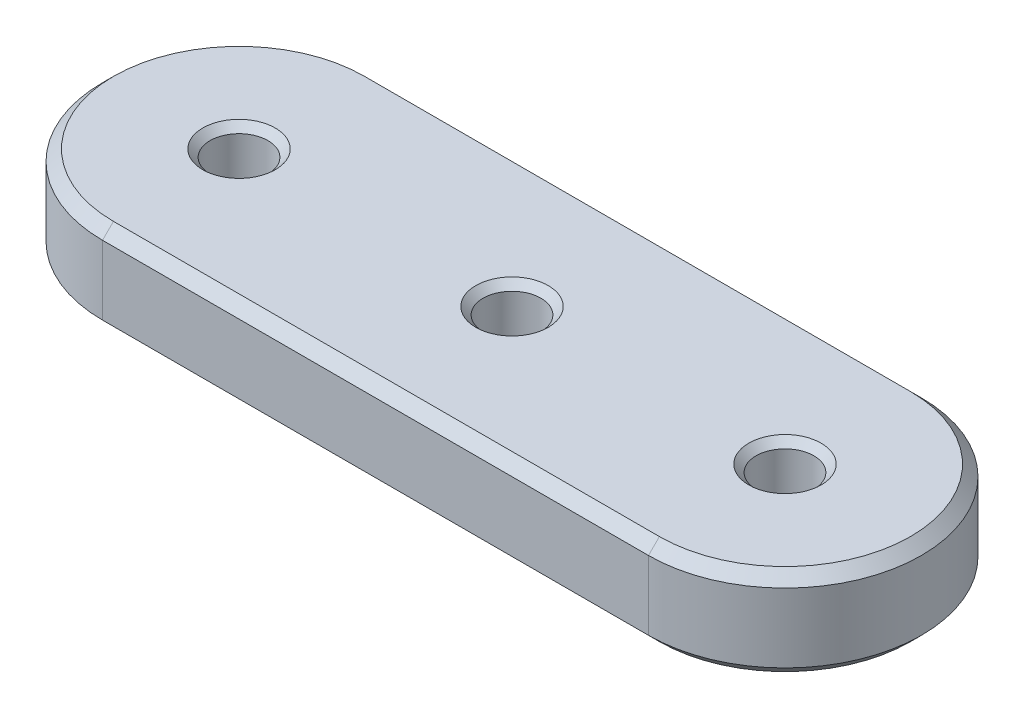
ISO-10303-21;
HEADER;
FILE_DESCRIPTION(('STEP AP214'),'2;1');
FILE_NAME('part.step','',(''),(''),'','','');
FILE_SCHEMA(('AUTOMOTIVE_DESIGN { 1 0 10303 214 1 1 1 1 }'));
ENDSEC;
DATA;
#1=APPLICATION_CONTEXT('core data for automotive mechanical design processes');
#2=APPLICATION_PROTOCOL_DEFINITION('international standard','automotive_design',2000,#1);
#3=PRODUCT_CONTEXT('',#1,'mechanical');
#4=PRODUCT('Part','Part','',(#3));
#5=PRODUCT_RELATED_PRODUCT_CATEGORY('part','',(#4));
#6=PRODUCT_DEFINITION_FORMATION('','',#4);
#7=PRODUCT_DEFINITION_CONTEXT('part definition',#1,'design');
#8=PRODUCT_DEFINITION('design','',#6,#7);
#9=PRODUCT_DEFINITION_SHAPE('','',#8);
#10=(LENGTH_UNIT() NAMED_UNIT(*) SI_UNIT(.MILLI.,.METRE.));
#11=(NAMED_UNIT(*) PLANE_ANGLE_UNIT() SI_UNIT($,.RADIAN.));
#12=(NAMED_UNIT(*) SI_UNIT($,.STERADIAN.) SOLID_ANGLE_UNIT());
#13=UNCERTAINTY_MEASURE_WITH_UNIT(LENGTH_MEASURE(1.E-05),#10,'distance_accuracy_value','');
#14=(GEOMETRIC_REPRESENTATION_CONTEXT(3) GLOBAL_UNCERTAINTY_ASSIGNED_CONTEXT((#13)) GLOBAL_UNIT_ASSIGNED_CONTEXT((#10,
#11,#12)) REPRESENTATION_CONTEXT('',''));
#15=CARTESIAN_POINT('',(0.,0.,0.));
#16=DIRECTION('',(0.,0.,1.));
#17=DIRECTION('',(1.,0.,0.));
#18=AXIS2_PLACEMENT_3D('',#15,#16,#17);
#19=CARTESIAN_POINT('',(-19.05,3.175,0.));
#20=DIRECTION('',(0.,-1.,0.));
#21=DIRECTION('',(0.,0.,-1.));
#22=AXIS2_PLACEMENT_3D('',#19,#20,#21);
#23=CYLINDRICAL_SURFACE('',#22,9.525);
#24=DIRECTION('',(0.,-1.,0.));
#25=VECTOR('',#24,1.);
#26=CARTESIAN_POINT('',(-19.05,3.175,9.525));
#27=LINE('',#26,#25);
#28=CARTESIAN_POINT('',(-19.05,2.413,9.525));
#29=VERTEX_POINT('',#28);
#30=CARTESIAN_POINT('',(-19.05,-2.41300000000001,9.525));
#31=VERTEX_POINT('',#30);
#32=EDGE_CURVE('E108',#29,#31,#27,.T.);
#33=ORIENTED_EDGE('',*,*,#32,.F.);
#34=CARTESIAN_POINT('',(-19.05,2.413,0.));
#35=DIRECTION('',(0.,1.,0.));
#36=DIRECTION('',(0.,0.,1.));
#37=AXIS2_PLACEMENT_3D('',#34,#35,#36);
#38=CIRCLE('',#37,9.525);
#39=CARTESIAN_POINT('',(-19.05,2.413,-9.525));
#40=VERTEX_POINT('',#39);
#41=EDGE_CURVE('E104',#29,#40,#38,.F.);
#42=ORIENTED_EDGE('',*,*,#41,.T.);
#43=DIRECTION('',(0.,-1.,0.));
#44=VECTOR('',#43,1.);
#45=CARTESIAN_POINT('',(-19.05,3.175,-9.525));
#46=LINE('',#45,#44);
#47=CARTESIAN_POINT('',(-19.05,-2.41300000000001,-9.525));
#48=VERTEX_POINT('',#47);
#49=EDGE_CURVE('E106',#40,#48,#46,.T.);
#50=ORIENTED_EDGE('',*,*,#49,.T.);
#51=CARTESIAN_POINT('',(-19.05,-2.41300000000001,0.));
#52=DIRECTION('',(0.,1.,0.));
#53=DIRECTION('',(0.,0.,1.));
#54=AXIS2_PLACEMENT_3D('',#51,#52,#53);
#55=CIRCLE('',#54,9.525);
#56=EDGE_CURVE('E114',#48,#31,#55,.T.);
#57=ORIENTED_EDGE('',*,*,#56,.T.);
#58=EDGE_LOOP('',(#33,#42,#50,#57));
#59=FACE_BOUND('',#58,.T.);
#60=ADVANCED_FACE('F35',(#59),#23,.T.);
#61=CARTESIAN_POINT('',(-19.05,3.175,9.525));
#62=DIRECTION('',(0.,0.,-1.));
#63=DIRECTION('',(-1.,0.,0.));
#64=AXIS2_PLACEMENT_3D('',#61,#62,#63);
#65=PLANE('',#64);
#66=DIRECTION('',(0.,-1.,0.));
#67=VECTOR('',#66,1.);
#68=CARTESIAN_POINT('',(19.05,3.175,9.52499999999999));
#69=LINE('',#68,#67);
#70=CARTESIAN_POINT('',(19.05,2.413,9.52499999999999));
#71=VERTEX_POINT('',#70);
#72=CARTESIAN_POINT('',(19.05,-2.41300000000001,9.52499999999999));
#73=VERTEX_POINT('',#72);
#74=EDGE_CURVE('E449',#71,#73,#69,.T.);
#75=ORIENTED_EDGE('',*,*,#74,.F.);
#76=DIRECTION('',(-1.,0.,0.));
#77=VECTOR('',#76,1.);
#78=CARTESIAN_POINT('',(-19.05,2.413,9.525));
#79=LINE('',#78,#77);
#80=EDGE_CURVE('E158',#71,#29,#79,.T.);
#81=ORIENTED_EDGE('',*,*,#80,.T.);
#82=ORIENTED_EDGE('',*,*,#32,.T.);
#83=DIRECTION('',(1.,0.,0.));
#84=VECTOR('',#83,1.);
#85=CARTESIAN_POINT('',(-19.05,-2.41300000000001,9.525));
#86=LINE('',#85,#84);
#87=EDGE_CURVE('E156',#31,#73,#86,.T.);
#88=ORIENTED_EDGE('',*,*,#87,.T.);
#89=EDGE_LOOP('',(#75,#81,#82,#88));
#90=FACE_BOUND('',#89,.T.);
#91=ADVANCED_FACE('F236',(#90),#65,.F.);
#92=CARTESIAN_POINT('',(19.05,3.175,0.));
#93=DIRECTION('',(0.,-1.,0.));
#94=DIRECTION('',(0.,0.,-1.));
#95=AXIS2_PLACEMENT_3D('',#92,#93,#94);
#96=CYLINDRICAL_SURFACE('',#95,9.525);
#97=DIRECTION('',(0.,-1.,0.));
#98=VECTOR('',#97,1.);
#99=CARTESIAN_POINT('',(19.05,3.175,-9.52500000000001));
#100=LINE('',#99,#98);
#101=CARTESIAN_POINT('',(19.05,2.413,-9.52500000000001));
#102=VERTEX_POINT('',#101);
#103=CARTESIAN_POINT('',(19.05,-2.41300000000001,-9.52500000000001));
#104=VERTEX_POINT('',#103);
#105=EDGE_CURVE('E125',#102,#104,#100,.T.);
#106=ORIENTED_EDGE('',*,*,#105,.F.);
#107=CARTESIAN_POINT('',(19.05,2.413,0.));
#108=DIRECTION('',(0.,1.,0.));
#109=DIRECTION('',(0.,0.,1.));
#110=AXIS2_PLACEMENT_3D('',#107,#108,#109);
#111=CIRCLE('',#110,9.525);
#112=EDGE_CURVE('E154',#102,#71,#111,.F.);
#113=ORIENTED_EDGE('',*,*,#112,.T.);
#114=ORIENTED_EDGE('',*,*,#74,.T.);
#115=CARTESIAN_POINT('',(19.05,-2.41300000000001,0.));
#116=DIRECTION('',(0.,1.,0.));
#117=DIRECTION('',(0.,0.,1.));
#118=AXIS2_PLACEMENT_3D('',#115,#116,#117);
#119=CIRCLE('',#118,9.525);
#120=EDGE_CURVE('E113',#73,#104,#119,.T.);
#121=ORIENTED_EDGE('',*,*,#120,.T.);
#122=EDGE_LOOP('',(#106,#113,#114,#121));
#123=FACE_BOUND('',#122,.T.);
#124=ADVANCED_FACE('F241',(#123),#96,.T.);
#125=CARTESIAN_POINT('',(-19.05,3.175,-9.525));
#126=DIRECTION('',(0.,0.,-1.));
#127=DIRECTION('',(-1.,0.,0.));
#128=AXIS2_PLACEMENT_3D('',#125,#126,#127);
#129=PLANE('',#128);
#130=ORIENTED_EDGE('',*,*,#49,.F.);
#131=DIRECTION('',(1.,0.,0.));
#132=VECTOR('',#131,1.);
#133=CARTESIAN_POINT('',(-19.05,2.413,-9.525));
#134=LINE('',#133,#132);
#135=EDGE_CURVE('E122',#40,#102,#134,.T.);
#136=ORIENTED_EDGE('',*,*,#135,.T.);
#137=ORIENTED_EDGE('',*,*,#105,.T.);
#138=DIRECTION('',(-1.,0.,0.));
#139=VECTOR('',#138,1.);
#140=CARTESIAN_POINT('',(-19.05,-2.41300000000001,-9.525));
#141=LINE('',#140,#139);
#142=EDGE_CURVE('E124',#104,#48,#141,.T.);
#143=ORIENTED_EDGE('',*,*,#142,.T.);
#144=EDGE_LOOP('',(#130,#136,#137,#143));
#145=FACE_BOUND('',#144,.T.);
#146=ADVANCED_FACE('F119',(#145),#129,.T.);
#147=CARTESIAN_POINT('',(-19.05,3.175,0.));
#148=DIRECTION('',(0.,1.,0.));
#149=DIRECTION('',(0.,0.,1.));
#150=AXIS2_PLACEMENT_3D('',#147,#148,#149);
#151=PLANE('',#150);
#152=CARTESIAN_POINT('',(19.05,3.175,0.));
#153=DIRECTION('',(0.,1.,0.));
#154=DIRECTION('',(0.,0.,1.));
#155=AXIS2_PLACEMENT_3D('',#152,#153,#154);
#156=CIRCLE('',#155,2.5273);
#157=CARTESIAN_POINT('',(19.05,3.175,2.5273));
#158=VERTEX_POINT('',#157);
#159=EDGE_CURVE('E192',#158,#158,#156,.F.);
#160=ORIENTED_EDGE('',*,*,#159,.T.);
#161=EDGE_LOOP('',(#160));
#162=FACE_BOUND('',#161,.T.);
#163=CARTESIAN_POINT('',(0.,3.175,0.));
#164=DIRECTION('',(0.,1.,0.));
#165=DIRECTION('',(0.,0.,1.));
#166=AXIS2_PLACEMENT_3D('',#163,#164,#165);
#167=CIRCLE('',#166,2.52730000000002);
#168=CARTESIAN_POINT('',(0.,3.175,2.52730000000002));
#169=VERTEX_POINT('',#168);
#170=EDGE_CURVE('E189',#169,#169,#167,.F.);
#171=ORIENTED_EDGE('',*,*,#170,.T.);
#172=EDGE_LOOP('',(#171));
#173=FACE_BOUND('',#172,.T.);
#174=CARTESIAN_POINT('',(-19.05,3.175,0.));
#175=DIRECTION('',(0.,1.,0.));
#176=DIRECTION('',(0.,0.,1.));
#177=AXIS2_PLACEMENT_3D('',#174,#175,#176);
#178=CIRCLE('',#177,2.5273);
#179=CARTESIAN_POINT('',(-19.05,3.175,2.5273));
#180=VERTEX_POINT('',#179);
#181=EDGE_CURVE('E186',#180,#180,#178,.F.);
#182=ORIENTED_EDGE('',*,*,#181,.T.);
#183=EDGE_LOOP('',(#182));
#184=FACE_BOUND('',#183,.T.);
#185=CARTESIAN_POINT('',(19.05,3.175,0.));
#186=DIRECTION('',(0.,1.,0.));
#187=DIRECTION('',(0.,0.,1.));
#188=AXIS2_PLACEMENT_3D('',#185,#186,#187);
#189=CIRCLE('',#188,8.76300000000001);
#190=CARTESIAN_POINT('',(19.05,3.175,8.763));
#191=VERTEX_POINT('',#190);
#192=CARTESIAN_POINT('',(19.05,3.175,-8.76300000000002));
#193=VERTEX_POINT('',#192);
#194=EDGE_CURVE('E143',#191,#193,#189,.T.);
#195=ORIENTED_EDGE('',*,*,#194,.T.);
#196=DIRECTION('',(-1.,0.,0.));
#197=VECTOR('',#196,1.);
#198=CARTESIAN_POINT('',(-19.05,3.175,-8.76300000000001));
#199=LINE('',#198,#197);
#200=CARTESIAN_POINT('',(-19.05,3.175,-8.76300000000001));
#201=VERTEX_POINT('',#200);
#202=EDGE_CURVE('E150',#193,#201,#199,.T.);
#203=ORIENTED_EDGE('',*,*,#202,.T.);
#204=CARTESIAN_POINT('',(-19.05,3.175,0.));
#205=DIRECTION('',(0.,1.,0.));
#206=DIRECTION('',(0.,0.,1.));
#207=AXIS2_PLACEMENT_3D('',#204,#205,#206);
#208=CIRCLE('',#207,8.76300000000001);
#209=CARTESIAN_POINT('',(-19.05,3.175,8.76300000000001));
#210=VERTEX_POINT('',#209);
#211=EDGE_CURVE('E131',#201,#210,#208,.T.);
#212=ORIENTED_EDGE('',*,*,#211,.T.);
#213=DIRECTION('',(1.,0.,0.));
#214=VECTOR('',#213,1.);
#215=CARTESIAN_POINT('',(19.05,3.175,8.763));
#216=LINE('',#215,#214);
#217=EDGE_CURVE('E141',#210,#191,#216,.T.);
#218=ORIENTED_EDGE('',*,*,#217,.T.);
#219=EDGE_LOOP('',(#195,#203,#212,#218));
#220=FACE_BOUND('',#219,.T.);
#221=ADVANCED_FACE('F222',(#162,#173,#184,#220),#151,.T.);
#222=CARTESIAN_POINT('',(-19.05,-3.175,0.));
#223=DIRECTION('',(0.,1.,0.));
#224=DIRECTION('',(0.,0.,1.));
#225=AXIS2_PLACEMENT_3D('',#222,#223,#224);
#226=PLANE('',#225);
#227=CARTESIAN_POINT('',(19.05,-3.175,0.));
#228=DIRECTION('',(0.,1.,0.));
#229=DIRECTION('',(0.,0.,1.));
#230=AXIS2_PLACEMENT_3D('',#227,#228,#229);
#231=CIRCLE('',#230,2.52729999999999);
#232=CARTESIAN_POINT('',(19.05,-3.175,2.52729999999998));
#233=VERTEX_POINT('',#232);
#234=EDGE_CURVE('E201',#233,#233,#231,.T.);
#235=ORIENTED_EDGE('',*,*,#234,.T.);
#236=EDGE_LOOP('',(#235));
#237=FACE_BOUND('',#236,.T.);
#238=CARTESIAN_POINT('',(0.,-3.175,0.));
#239=DIRECTION('',(0.,1.,0.));
#240=DIRECTION('',(0.,0.,1.));
#241=AXIS2_PLACEMENT_3D('',#238,#239,#240);
#242=CIRCLE('',#241,2.52729999999999);
#243=CARTESIAN_POINT('',(0.,-3.175,2.52729999999999));
#244=VERTEX_POINT('',#243);
#245=EDGE_CURVE('E198',#244,#244,#242,.T.);
#246=ORIENTED_EDGE('',*,*,#245,.T.);
#247=EDGE_LOOP('',(#246));
#248=FACE_BOUND('',#247,.T.);
#249=CARTESIAN_POINT('',(-19.05,-3.175,0.));
#250=DIRECTION('',(0.,1.,0.));
#251=DIRECTION('',(0.,0.,1.));
#252=AXIS2_PLACEMENT_3D('',#249,#250,#251);
#253=CIRCLE('',#252,2.52729999999999);
#254=CARTESIAN_POINT('',(-19.05,-3.175,2.52729999999999));
#255=VERTEX_POINT('',#254);
#256=EDGE_CURVE('E195',#255,#255,#253,.T.);
#257=ORIENTED_EDGE('',*,*,#256,.T.);
#258=EDGE_LOOP('',(#257));
#259=FACE_BOUND('',#258,.T.);
#260=CARTESIAN_POINT('',(-19.05,-3.175,0.));
#261=DIRECTION('',(0.,1.,0.));
#262=DIRECTION('',(0.,0.,1.));
#263=AXIS2_PLACEMENT_3D('',#260,#261,#262);
#264=CIRCLE('',#263,8.763);
#265=CARTESIAN_POINT('',(-19.05,-3.175,8.763));
#266=VERTEX_POINT('',#265);
#267=CARTESIAN_POINT('',(-19.05,-3.175,-8.763));
#268=VERTEX_POINT('',#267);
#269=EDGE_CURVE('E50',#266,#268,#264,.F.);
#270=ORIENTED_EDGE('',*,*,#269,.T.);
#271=DIRECTION('',(1.,0.,0.));
#272=VECTOR('',#271,1.);
#273=CARTESIAN_POINT('',(19.05,-3.175,-8.76300000000001));
#274=LINE('',#273,#272);
#275=CARTESIAN_POINT('',(19.05,-3.175,-8.76300000000001));
#276=VERTEX_POINT('',#275);
#277=EDGE_CURVE('E165',#268,#276,#274,.T.);
#278=ORIENTED_EDGE('',*,*,#277,.T.);
#279=CARTESIAN_POINT('',(19.05,-3.175,0.));
#280=DIRECTION('',(0.,1.,0.));
#281=DIRECTION('',(0.,0.,1.));
#282=AXIS2_PLACEMENT_3D('',#279,#280,#281);
#283=CIRCLE('',#282,8.763);
#284=CARTESIAN_POINT('',(19.05,-3.175,8.76299999999999));
#285=VERTEX_POINT('',#284);
#286=EDGE_CURVE('E162',#276,#285,#283,.F.);
#287=ORIENTED_EDGE('',*,*,#286,.T.);
#288=DIRECTION('',(-1.,0.,0.));
#289=VECTOR('',#288,1.);
#290=CARTESIAN_POINT('',(-19.05,-3.175,8.763));
#291=LINE('',#290,#289);
#292=EDGE_CURVE('E160',#285,#266,#291,.T.);
#293=ORIENTED_EDGE('',*,*,#292,.T.);
#294=EDGE_LOOP('',(#270,#278,#287,#293));
#295=FACE_BOUND('',#294,.T.);
#296=ADVANCED_FACE('F219',(#237,#248,#259,#295),#226,.F.);
#297=CARTESIAN_POINT('',(0.,3.175,0.));
#298=DIRECTION('',(0.,1.,0.));
#299=DIRECTION('',(0.,0.,1.));
#300=AXIS2_PLACEMENT_3D('',#297,#298,#299);
#301=CYLINDRICAL_SURFACE('',#300,2.0193);
#302=CARTESIAN_POINT('',(0.,2.66699999999999,0.));
#303=DIRECTION('',(0.,1.,0.));
#304=DIRECTION('',(0.,0.,1.));
#305=AXIS2_PLACEMENT_3D('',#302,#303,#304);
#306=CIRCLE('',#305,2.0193);
#307=CARTESIAN_POINT('',(0.,2.66699999999999,2.0193));
#308=VERTEX_POINT('',#307);
#309=EDGE_CURVE('E207',#308,#308,#306,.T.);
#310=ORIENTED_EDGE('',*,*,#309,.T.);
#311=EDGE_LOOP('',(#310));
#312=FACE_BOUND('',#311,.T.);
#313=CARTESIAN_POINT('',(0.,-2.667,0.));
#314=DIRECTION('',(0.,1.,0.));
#315=DIRECTION('',(0.,0.,1.));
#316=AXIS2_PLACEMENT_3D('',#313,#314,#315);
#317=CIRCLE('',#316,2.0193);
#318=CARTESIAN_POINT('',(0.,-2.667,2.0193));
#319=VERTEX_POINT('',#318);
#320=EDGE_CURVE('E204',#319,#319,#317,.F.);
#321=ORIENTED_EDGE('',*,*,#320,.T.);
#322=EDGE_LOOP('',(#321));
#323=FACE_BOUND('',#322,.T.);
#324=ADVANCED_FACE('F221',(#312,#323),#301,.F.);
#325=CARTESIAN_POINT('',(-19.05,3.175,0.));
#326=DIRECTION('',(0.,1.,0.));
#327=DIRECTION('',(0.,0.,1.));
#328=AXIS2_PLACEMENT_3D('',#325,#326,#327);
#329=CYLINDRICAL_SURFACE('',#328,2.0193);
#330=CARTESIAN_POINT('',(-19.05,2.66699999999999,0.));
#331=DIRECTION('',(0.,1.,0.));
#332=DIRECTION('',(0.,0.,1.));
#333=AXIS2_PLACEMENT_3D('',#330,#331,#332);
#334=CIRCLE('',#333,2.0193);
#335=CARTESIAN_POINT('',(-19.05,2.66699999999999,2.0193));
#336=VERTEX_POINT('',#335);
#337=EDGE_CURVE('E11',#336,#336,#334,.T.);
#338=ORIENTED_EDGE('',*,*,#337,.T.);
#339=EDGE_LOOP('',(#338));
#340=FACE_BOUND('',#339,.T.);
#341=CARTESIAN_POINT('',(-19.05,-2.667,0.));
#342=DIRECTION('',(0.,1.,0.));
#343=DIRECTION('',(0.,0.,1.));
#344=AXIS2_PLACEMENT_3D('',#341,#342,#343);
#345=CIRCLE('',#344,2.0193);
#346=CARTESIAN_POINT('',(-19.05,-2.667,2.0193));
#347=VERTEX_POINT('',#346);
#348=EDGE_CURVE('E43',#347,#347,#345,.F.);
#349=ORIENTED_EDGE('',*,*,#348,.T.);
#350=EDGE_LOOP('',(#349));
#351=FACE_BOUND('',#350,.T.);
#352=ADVANCED_FACE('F212',(#340,#351),#329,.F.);
#353=CARTESIAN_POINT('',(19.05,3.175,0.));
#354=DIRECTION('',(0.,1.,0.));
#355=DIRECTION('',(0.,0.,1.));
#356=AXIS2_PLACEMENT_3D('',#353,#354,#355);
#357=CYLINDRICAL_SURFACE('',#356,2.0193);
#358=CARTESIAN_POINT('',(19.05,2.66699999999999,0.));
#359=DIRECTION('',(0.,1.,0.));
#360=DIRECTION('',(0.,0.,1.));
#361=AXIS2_PLACEMENT_3D('',#358,#359,#360);
#362=CIRCLE('',#361,2.0193);
#363=CARTESIAN_POINT('',(19.05,2.66699999999999,2.01929999999999));
#364=VERTEX_POINT('',#363);
#365=EDGE_CURVE('E183',#364,#364,#362,.T.);
#366=ORIENTED_EDGE('',*,*,#365,.T.);
#367=EDGE_LOOP('',(#366));
#368=FACE_BOUND('',#367,.T.);
#369=CARTESIAN_POINT('',(19.05,-2.667,0.));
#370=DIRECTION('',(0.,1.,0.));
#371=DIRECTION('',(0.,0.,1.));
#372=AXIS2_PLACEMENT_3D('',#369,#370,#371);
#373=CIRCLE('',#372,2.0193);
#374=CARTESIAN_POINT('',(19.05,-2.667,2.01929999999999));
#375=VERTEX_POINT('',#374);
#376=EDGE_CURVE('E167',#375,#375,#373,.F.);
#377=ORIENTED_EDGE('',*,*,#376,.T.);
#378=EDGE_LOOP('',(#377));
#379=FACE_BOUND('',#378,.T.);
#380=ADVANCED_FACE('F258',(#368,#379),#357,.F.);
#381=CARTESIAN_POINT('',(-19.05,3.175,8.76300000000001));
#382=DIRECTION('',(0.,0.707106781186544,0.707106781186551));
#383=DIRECTION('',(-1.,0.,0.));
#384=AXIS2_PLACEMENT_3D('',#381,#382,#383);
#385=PLANE('',#384);
#386=DIRECTION('',(0.,-0.707106781186551,0.707106781186544));
#387=VECTOR('',#386,1.);
#388=CARTESIAN_POINT('',(19.05,3.175,8.763));
#389=LINE('',#388,#387);
#390=EDGE_CURVE('E135',#191,#71,#389,.T.);
#391=ORIENTED_EDGE('',*,*,#390,.F.);
#392=ORIENTED_EDGE('',*,*,#217,.F.);
#393=DIRECTION('',(0.,0.707106781186551,-0.707106781186544));
#394=VECTOR('',#393,1.);
#395=CARTESIAN_POINT('',(-19.05,2.413,9.525));
#396=LINE('',#395,#394);
#397=EDGE_CURVE('E126',#29,#210,#396,.T.);
#398=ORIENTED_EDGE('',*,*,#397,.F.);
#399=ORIENTED_EDGE('',*,*,#80,.F.);
#400=EDGE_LOOP('',(#391,#392,#398,#399));
#401=FACE_BOUND('',#400,.T.);
#402=ADVANCED_FACE('F255',(#401),#385,.T.);
#403=CARTESIAN_POINT('',(-19.05,3.175,0.));
#404=DIRECTION('',(0.,-1.,0.));
#405=DIRECTION('',(0.,0.,-1.));
#406=AXIS2_PLACEMENT_3D('',#403,#404,#405);
#407=CONICAL_SURFACE('',#406,8.76300000000001,0.785398163397444);
#408=ORIENTED_EDGE('',*,*,#397,.T.);
#409=ORIENTED_EDGE('',*,*,#211,.F.);
#410=DIRECTION('',(0.,0.707106781186551,0.707106781186544));
#411=VECTOR('',#410,1.);
#412=CARTESIAN_POINT('',(-19.05,2.413,-9.525));
#413=LINE('',#412,#411);
#414=EDGE_CURVE('E129',#40,#201,#413,.T.);
#415=ORIENTED_EDGE('',*,*,#414,.F.);
#416=ORIENTED_EDGE('',*,*,#41,.F.);
#417=EDGE_LOOP('',(#408,#409,#415,#416));
#418=FACE_BOUND('',#417,.T.);
#419=ADVANCED_FACE('F130',(#418),#407,.T.);
#420=CARTESIAN_POINT('',(19.05,3.175,0.));
#421=DIRECTION('',(0.,-1.,0.));
#422=DIRECTION('',(0.,0.,-1.));
#423=AXIS2_PLACEMENT_3D('',#420,#421,#422);
#424=CONICAL_SURFACE('',#423,8.76300000000001,0.785398163397444);
#425=ORIENTED_EDGE('',*,*,#390,.T.);
#426=ORIENTED_EDGE('',*,*,#112,.F.);
#427=DIRECTION('',(0.,-0.707106781186551,-0.707106781186544));
#428=VECTOR('',#427,1.);
#429=CARTESIAN_POINT('',(19.05,3.175,-8.76300000000002));
#430=LINE('',#429,#428);
#431=EDGE_CURVE('E136',#193,#102,#430,.T.);
#432=ORIENTED_EDGE('',*,*,#431,.F.);
#433=ORIENTED_EDGE('',*,*,#194,.F.);
#434=EDGE_LOOP('',(#425,#426,#432,#433));
#435=FACE_BOUND('',#434,.T.);
#436=ADVANCED_FACE('F249',(#435),#424,.T.);
#437=CARTESIAN_POINT('',(-19.05,2.413,-9.525));
#438=DIRECTION('',(0.,-0.707106781186544,0.707106781186551));
#439=DIRECTION('',(1.,0.,0.));
#440=AXIS2_PLACEMENT_3D('',#437,#438,#439);
#441=PLANE('',#440);
#442=ORIENTED_EDGE('',*,*,#414,.T.);
#443=ORIENTED_EDGE('',*,*,#202,.F.);
#444=ORIENTED_EDGE('',*,*,#431,.T.);
#445=ORIENTED_EDGE('',*,*,#135,.F.);
#446=EDGE_LOOP('',(#442,#443,#444,#445));
#447=FACE_BOUND('',#446,.T.);
#448=ADVANCED_FACE('F138',(#447),#441,.F.);
#449=CARTESIAN_POINT('',(-19.05,-2.41300000000001,9.525));
#450=DIRECTION('',(0.,0.707106781186551,-0.707106781186544));
#451=DIRECTION('',(1.,0.,0.));
#452=AXIS2_PLACEMENT_3D('',#449,#450,#451);
#453=PLANE('',#452);
#454=DIRECTION('',(0.,-0.707106781186544,-0.707106781186551));
#455=VECTOR('',#454,1.);
#456=CARTESIAN_POINT('',(19.05,-2.41300000000001,9.52499999999999));
#457=LINE('',#456,#455);
#458=EDGE_CURVE('E176',#73,#285,#457,.T.);
#459=ORIENTED_EDGE('',*,*,#458,.F.);
#460=ORIENTED_EDGE('',*,*,#87,.F.);
#461=DIRECTION('',(0.,0.707106781186544,0.707106781186551));
#462=VECTOR('',#461,1.);
#463=CARTESIAN_POINT('',(-19.05,-3.175,8.763));
#464=LINE('',#463,#462);
#465=EDGE_CURVE('E168',#266,#31,#464,.T.);
#466=ORIENTED_EDGE('',*,*,#465,.F.);
#467=ORIENTED_EDGE('',*,*,#292,.F.);
#468=EDGE_LOOP('',(#459,#460,#466,#467));
#469=FACE_BOUND('',#468,.T.);
#470=ADVANCED_FACE('F248',(#469),#453,.F.);
#471=CARTESIAN_POINT('',(-19.05,-2.41300000000001,0.));
#472=DIRECTION('',(0.,1.,0.));
#473=DIRECTION('',(0.,0.,1.));
#474=AXIS2_PLACEMENT_3D('',#471,#472,#473);
#475=CONICAL_SURFACE('',#474,9.525,0.785398163397453);
#476=ORIENTED_EDGE('',*,*,#465,.T.);
#477=ORIENTED_EDGE('',*,*,#56,.F.);
#478=DIRECTION('',(0.,0.707106781186544,-0.707106781186551));
#479=VECTOR('',#478,1.);
#480=CARTESIAN_POINT('',(-19.05,-3.175,-8.763));
#481=LINE('',#480,#479);
#482=EDGE_CURVE('E174',#268,#48,#481,.T.);
#483=ORIENTED_EDGE('',*,*,#482,.F.);
#484=ORIENTED_EDGE('',*,*,#269,.F.);
#485=EDGE_LOOP('',(#476,#477,#483,#484));
#486=FACE_BOUND('',#485,.T.);
#487=ADVANCED_FACE('F267',(#486),#475,.T.);
#488=CARTESIAN_POINT('',(19.05,-2.41300000000001,0.));
#489=DIRECTION('',(0.,1.,0.));
#490=DIRECTION('',(0.,0.,1.));
#491=AXIS2_PLACEMENT_3D('',#488,#489,#490);
#492=CONICAL_SURFACE('',#491,9.525,0.785398163397453);
#493=ORIENTED_EDGE('',*,*,#458,.T.);
#494=ORIENTED_EDGE('',*,*,#286,.F.);
#495=DIRECTION('',(0.,-0.707106781186544,0.707106781186551));
#496=VECTOR('',#495,1.);
#497=CARTESIAN_POINT('',(19.05,-2.41300000000001,-9.52500000000001));
#498=LINE('',#497,#496);
#499=EDGE_CURVE('E58',#104,#276,#498,.T.);
#500=ORIENTED_EDGE('',*,*,#499,.F.);
#501=ORIENTED_EDGE('',*,*,#120,.F.);
#502=EDGE_LOOP('',(#493,#494,#500,#501));
#503=FACE_BOUND('',#502,.T.);
#504=ADVANCED_FACE('F264',(#503),#492,.T.);
#505=CARTESIAN_POINT('',(-19.05,-3.175,-8.763));
#506=DIRECTION('',(0.,-0.707106781186551,-0.707106781186544));
#507=DIRECTION('',(-1.,0.,0.));
#508=AXIS2_PLACEMENT_3D('',#505,#506,#507);
#509=PLANE('',#508);
#510=ORIENTED_EDGE('',*,*,#482,.T.);
#511=ORIENTED_EDGE('',*,*,#142,.F.);
#512=ORIENTED_EDGE('',*,*,#499,.T.);
#513=ORIENTED_EDGE('',*,*,#277,.F.);
#514=EDGE_LOOP('',(#510,#511,#512,#513));
#515=FACE_BOUND('',#514,.T.);
#516=ADVANCED_FACE('F260',(#515),#509,.T.);
#517=CARTESIAN_POINT('',(19.05,2.66699999999999,0.));
#518=DIRECTION('',(0.,1.,0.));
#519=DIRECTION('',(0.,0.,1.));
#520=AXIS2_PLACEMENT_3D('',#517,#518,#519);
#521=CONICAL_SURFACE('',#520,2.0193,0.785398163397448);
#522=ORIENTED_EDGE('',*,*,#159,.F.);
#523=EDGE_LOOP('',(#522));
#524=FACE_BOUND('',#523,.T.);
#525=ORIENTED_EDGE('',*,*,#365,.F.);
#526=EDGE_LOOP('',(#525));
#527=FACE_BOUND('',#526,.T.);
#528=ADVANCED_FACE('F263',(#524,#527),#521,.F.);
#529=CARTESIAN_POINT('',(19.05,-3.175,0.));
#530=DIRECTION('',(0.,-1.,0.));
#531=DIRECTION('',(0.,0.,-1.));
#532=AXIS2_PLACEMENT_3D('',#529,#530,#531);
#533=CONICAL_SURFACE('',#532,2.52729999999999,0.785398163397442);
#534=ORIENTED_EDGE('',*,*,#376,.F.);
#535=EDGE_LOOP('',(#534));
#536=FACE_BOUND('',#535,.T.);
#537=ORIENTED_EDGE('',*,*,#234,.F.);
#538=EDGE_LOOP('',(#537));
#539=FACE_BOUND('',#538,.T.);
#540=ADVANCED_FACE('F277',(#536,#539),#533,.F.);
#541=CARTESIAN_POINT('',(0.,2.66699999999999,0.));
#542=DIRECTION('',(0.,1.,0.));
#543=DIRECTION('',(0.,0.,1.));
#544=AXIS2_PLACEMENT_3D('',#541,#542,#543);
#545=CONICAL_SURFACE('',#544,2.0193,0.785398163397455);
#546=ORIENTED_EDGE('',*,*,#170,.F.);
#547=EDGE_LOOP('',(#546));
#548=FACE_BOUND('',#547,.T.);
#549=ORIENTED_EDGE('',*,*,#309,.F.);
#550=EDGE_LOOP('',(#549));
#551=FACE_BOUND('',#550,.T.);
#552=ADVANCED_FACE('F281',(#548,#551),#545,.F.);
#553=CARTESIAN_POINT('',(0.,-3.175,0.));
#554=DIRECTION('',(0.,-1.,0.));
#555=DIRECTION('',(0.,0.,-1.));
#556=AXIS2_PLACEMENT_3D('',#553,#554,#555);
#557=CONICAL_SURFACE('',#556,2.52729999999999,0.785398163397442);
#558=ORIENTED_EDGE('',*,*,#320,.F.);
#559=EDGE_LOOP('',(#558));
#560=FACE_BOUND('',#559,.T.);
#561=ORIENTED_EDGE('',*,*,#245,.F.);
#562=EDGE_LOOP('',(#561));
#563=FACE_BOUND('',#562,.T.);
#564=ADVANCED_FACE('F285',(#560,#563),#557,.F.);
#565=CARTESIAN_POINT('',(-19.05,2.66699999999999,0.));
#566=DIRECTION('',(0.,1.,0.));
#567=DIRECTION('',(0.,0.,1.));
#568=AXIS2_PLACEMENT_3D('',#565,#566,#567);
#569=CONICAL_SURFACE('',#568,2.0193,0.785398163397448);
#570=ORIENTED_EDGE('',*,*,#181,.F.);
#571=EDGE_LOOP('',(#570));
#572=FACE_BOUND('',#571,.T.);
#573=ORIENTED_EDGE('',*,*,#337,.F.);
#574=EDGE_LOOP('',(#573));
#575=FACE_BOUND('',#574,.T.);
#576=ADVANCED_FACE('F216',(#572,#575),#569,.F.);
#577=CARTESIAN_POINT('',(-19.05,-3.175,0.));
#578=DIRECTION('',(0.,-1.,0.));
#579=DIRECTION('',(0.,0.,-1.));
#580=AXIS2_PLACEMENT_3D('',#577,#578,#579);
#581=CONICAL_SURFACE('',#580,2.52729999999999,0.785398163397442);
#582=ORIENTED_EDGE('',*,*,#348,.F.);
#583=EDGE_LOOP('',(#582));
#584=FACE_BOUND('',#583,.T.);
#585=ORIENTED_EDGE('',*,*,#256,.F.);
#586=EDGE_LOOP('',(#585));
#587=FACE_BOUND('',#586,.T.);
#588=ADVANCED_FACE('F37',(#584,#587),#581,.F.);
#589=CLOSED_SHELL('',(#60,#91,#124,#146,#221,#296,#324,#352,#380,#402,#419,#436,#448,#470,#487,
#504,#516,#528,#540,#552,#564,#576,#588));
#590=MANIFOLD_SOLID_BREP('B2',#589);
#591=ADVANCED_BREP_SHAPE_REPRESENTATION('',(#18,#590),#14);
#592=SHAPE_DEFINITION_REPRESENTATION(#9,#591);
ENDSEC;
END-ISO-10303-21;
